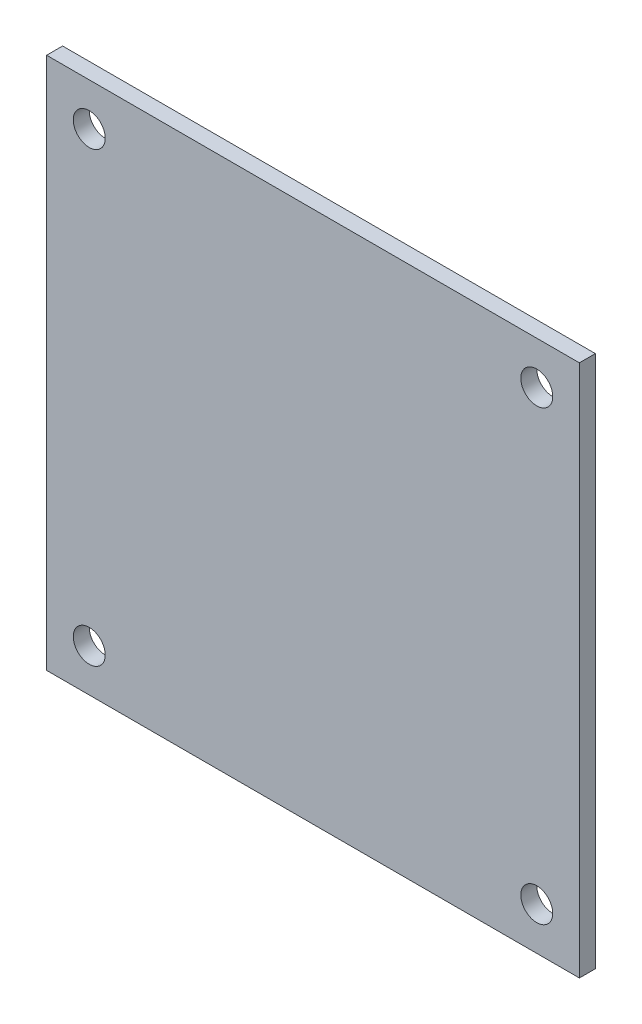
ISO-10303-21;
HEADER;
FILE_DESCRIPTION(('STEP AP214'),'2;1');
FILE_NAME('part.step','',(''),(''),'','','');
FILE_SCHEMA(('AUTOMOTIVE_DESIGN { 1 0 10303 214 1 1 1 1 }'));
ENDSEC;
DATA;
#1=APPLICATION_CONTEXT('core data for automotive mechanical design processes');
#2=APPLICATION_PROTOCOL_DEFINITION('international standard','automotive_design',2000,#1);
#3=PRODUCT_CONTEXT('',#1,'mechanical');
#4=PRODUCT('Part','Part','',(#3));
#5=PRODUCT_RELATED_PRODUCT_CATEGORY('part','',(#4));
#6=PRODUCT_DEFINITION_FORMATION('','',#4);
#7=PRODUCT_DEFINITION_CONTEXT('part definition',#1,'design');
#8=PRODUCT_DEFINITION('design','',#6,#7);
#9=PRODUCT_DEFINITION_SHAPE('','',#8);
#10=(LENGTH_UNIT() NAMED_UNIT(*) SI_UNIT(.MILLI.,.METRE.));
#11=(NAMED_UNIT(*) PLANE_ANGLE_UNIT() SI_UNIT($,.RADIAN.));
#12=(NAMED_UNIT(*) SI_UNIT($,.STERADIAN.) SOLID_ANGLE_UNIT());
#13=UNCERTAINTY_MEASURE_WITH_UNIT(LENGTH_MEASURE(1.E-05),#10,'distance_accuracy_value','');
#14=(GEOMETRIC_REPRESENTATION_CONTEXT(3) GLOBAL_UNCERTAINTY_ASSIGNED_CONTEXT((#13)) GLOBAL_UNIT_ASSIGNED_CONTEXT((#10,
#11,#12)) REPRESENTATION_CONTEXT('',''));
#15=CARTESIAN_POINT('',(0.,0.,0.));
#16=DIRECTION('',(0.,0.,1.));
#17=DIRECTION('',(1.,0.,0.));
#18=AXIS2_PLACEMENT_3D('',#15,#16,#17);
#19=CARTESIAN_POINT('',(-16.7503442350181,33.8891014975042,1.5));
#20=DIRECTION('',(1.,0.,0.));
#21=DIRECTION('',(0.,1.,0.));
#22=AXIS2_PLACEMENT_3D('',#19,#20,#21);
#23=PLANE('',#22);
#24=DIRECTION('',(0.,-1.,0.));
#25=VECTOR('',#24,1.);
#26=CARTESIAN_POINT('',(-16.7503442350181,33.8891014975042,0.));
#27=LINE('',#26,#25);
#28=CARTESIAN_POINT('',(-16.7503442350181,33.8891014975042,0.));
#29=VERTEX_POINT('',#28);
#30=CARTESIAN_POINT('',(-16.7503442350181,-16.1108985024958,0.));
#31=VERTEX_POINT('',#30);
#32=EDGE_CURVE('E97',#29,#31,#27,.T.);
#33=ORIENTED_EDGE('',*,*,#32,.T.);
#34=DIRECTION('',(0.,0.,-1.));
#35=VECTOR('',#34,1.);
#36=CARTESIAN_POINT('',(-16.7503442350181,-16.1108985024958,1.5));
#37=LINE('',#36,#35);
#38=CARTESIAN_POINT('',(-16.7503442350181,-16.1108985024958,1.5));
#39=VERTEX_POINT('',#38);
#40=EDGE_CURVE('E11',#39,#31,#37,.T.);
#41=ORIENTED_EDGE('',*,*,#40,.F.);
#42=DIRECTION('',(0.,-1.,0.));
#43=VECTOR('',#42,1.);
#44=CARTESIAN_POINT('',(-16.7503442350181,33.8891014975042,1.5));
#45=LINE('',#44,#43);
#46=CARTESIAN_POINT('',(-16.7503442350181,33.8891014975042,1.5));
#47=VERTEX_POINT('',#46);
#48=EDGE_CURVE('E84',#47,#39,#45,.T.);
#49=ORIENTED_EDGE('',*,*,#48,.F.);
#50=DIRECTION('',(0.,0.,-1.));
#51=VECTOR('',#50,1.);
#52=CARTESIAN_POINT('',(-16.7503442350181,33.8891014975042,1.5));
#53=LINE('',#52,#51);
#54=EDGE_CURVE('E93',#47,#29,#53,.T.);
#55=ORIENTED_EDGE('',*,*,#54,.T.);
#56=EDGE_LOOP('',(#33,#41,#49,#55));
#57=FACE_BOUND('',#56,.T.);
#58=ADVANCED_FACE('F31',(#57),#23,.F.);
#59=CARTESIAN_POINT('',(-16.7503442350181,-16.1108985024958,1.5));
#60=DIRECTION('',(0.,1.,0.));
#61=DIRECTION('',(0.,0.,1.));
#62=AXIS2_PLACEMENT_3D('',#59,#60,#61);
#63=PLANE('',#62);
#64=DIRECTION('',(1.,0.,0.));
#65=VECTOR('',#64,1.);
#66=CARTESIAN_POINT('',(-16.7503442350181,-16.1108985024958,0.));
#67=LINE('',#66,#65);
#68=CARTESIAN_POINT('',(33.2496557649819,-16.1108985024958,0.));
#69=VERTEX_POINT('',#68);
#70=EDGE_CURVE('E88',#31,#69,#67,.T.);
#71=ORIENTED_EDGE('',*,*,#70,.T.);
#72=DIRECTION('',(0.,0.,-1.));
#73=VECTOR('',#72,1.);
#74=CARTESIAN_POINT('',(33.2496557649819,-16.1108985024958,1.5));
#75=LINE('',#74,#73);
#76=CARTESIAN_POINT('',(33.2496557649819,-16.1108985024958,1.5));
#77=VERTEX_POINT('',#76);
#78=EDGE_CURVE('E40',#77,#69,#75,.T.);
#79=ORIENTED_EDGE('',*,*,#78,.F.);
#80=DIRECTION('',(1.,0.,0.));
#81=VECTOR('',#80,1.);
#82=CARTESIAN_POINT('',(-16.7503442350181,-16.1108985024958,1.5));
#83=LINE('',#82,#81);
#84=EDGE_CURVE('E79',#39,#77,#83,.T.);
#85=ORIENTED_EDGE('',*,*,#84,.F.);
#86=ORIENTED_EDGE('',*,*,#40,.T.);
#87=EDGE_LOOP('',(#71,#79,#85,#86));
#88=FACE_BOUND('',#87,.T.);
#89=ADVANCED_FACE('F87',(#88),#63,.F.);
#90=CARTESIAN_POINT('',(33.2496557649819,33.8891014975042,1.5));
#91=DIRECTION('',(-1.,0.,0.));
#92=DIRECTION('',(0.,-1.,0.));
#93=AXIS2_PLACEMENT_3D('',#90,#91,#92);
#94=PLANE('',#93);
#95=DIRECTION('',(0.,1.,0.));
#96=VECTOR('',#95,1.);
#97=CARTESIAN_POINT('',(33.2496557649819,33.8891014975042,0.));
#98=LINE('',#97,#96);
#99=CARTESIAN_POINT('',(33.2496557649819,33.8891014975042,0.));
#100=VERTEX_POINT('',#99);
#101=EDGE_CURVE('E66',#69,#100,#98,.T.);
#102=ORIENTED_EDGE('',*,*,#101,.T.);
#103=DIRECTION('',(0.,0.,-1.));
#104=VECTOR('',#103,1.);
#105=CARTESIAN_POINT('',(33.2496557649819,33.8891014975042,1.5));
#106=LINE('',#105,#104);
#107=CARTESIAN_POINT('',(33.2496557649819,33.8891014975042,1.5));
#108=VERTEX_POINT('',#107);
#109=EDGE_CURVE('E89',#108,#100,#106,.T.);
#110=ORIENTED_EDGE('',*,*,#109,.F.);
#111=DIRECTION('',(0.,1.,0.));
#112=VECTOR('',#111,1.);
#113=CARTESIAN_POINT('',(33.2496557649819,33.8891014975042,1.5));
#114=LINE('',#113,#112);
#115=EDGE_CURVE('E82',#77,#108,#114,.T.);
#116=ORIENTED_EDGE('',*,*,#115,.F.);
#117=ORIENTED_EDGE('',*,*,#78,.T.);
#118=EDGE_LOOP('',(#102,#110,#116,#117));
#119=FACE_BOUND('',#118,.T.);
#120=ADVANCED_FACE('F91',(#119),#94,.F.);
#121=CARTESIAN_POINT('',(-16.7503442350181,33.8891014975042,1.5));
#122=DIRECTION('',(0.,-1.,0.));
#123=DIRECTION('',(0.,0.,-1.));
#124=AXIS2_PLACEMENT_3D('',#121,#122,#123);
#125=PLANE('',#124);
#126=DIRECTION('',(-1.,0.,0.));
#127=VECTOR('',#126,1.);
#128=CARTESIAN_POINT('',(-16.7503442350181,33.8891014975042,0.));
#129=LINE('',#128,#127);
#130=EDGE_CURVE('E72',#100,#29,#129,.T.);
#131=ORIENTED_EDGE('',*,*,#130,.T.);
#132=ORIENTED_EDGE('',*,*,#54,.F.);
#133=DIRECTION('',(-1.,0.,0.));
#134=VECTOR('',#133,1.);
#135=CARTESIAN_POINT('',(-16.7503442350181,33.8891014975042,1.5));
#136=LINE('',#135,#134);
#137=EDGE_CURVE('E49',#108,#47,#136,.T.);
#138=ORIENTED_EDGE('',*,*,#137,.F.);
#139=ORIENTED_EDGE('',*,*,#109,.T.);
#140=EDGE_LOOP('',(#131,#132,#138,#139));
#141=FACE_BOUND('',#140,.T.);
#142=ADVANCED_FACE('F135',(#141),#125,.F.);
#143=CARTESIAN_POINT('',(-16.7503442350181,-16.1108985024958,1.5));
#144=DIRECTION('',(0.,0.,1.));
#145=DIRECTION('',(1.,0.,0.));
#146=AXIS2_PLACEMENT_3D('',#143,#144,#145);
#147=PLANE('',#146);
#148=CARTESIAN_POINT('',(29.2496557649819,-12.1108985024957,1.5));
#149=DIRECTION('',(0.,0.,1.));
#150=DIRECTION('',(1.,0.,0.));
#151=AXIS2_PLACEMENT_3D('',#148,#149,#150);
#152=CIRCLE('',#151,1.5);
#153=CARTESIAN_POINT('',(30.7496557649819,-12.1108985024957,1.5));
#154=VERTEX_POINT('',#153);
#155=EDGE_CURVE('E124',#154,#154,#152,.T.);
#156=ORIENTED_EDGE('',*,*,#155,.F.);
#157=EDGE_LOOP('',(#156));
#158=FACE_BOUND('',#157,.T.);
#159=CARTESIAN_POINT('',(29.2496557649818,29.8891014975042,1.5));
#160=DIRECTION('',(0.,0.,1.));
#161=DIRECTION('',(1.,0.,0.));
#162=AXIS2_PLACEMENT_3D('',#159,#160,#161);
#163=CIRCLE('',#162,1.5);
#164=CARTESIAN_POINT('',(30.7496557649818,29.8891014975042,1.5));
#165=VERTEX_POINT('',#164);
#166=EDGE_CURVE('E114',#165,#165,#163,.T.);
#167=ORIENTED_EDGE('',*,*,#166,.F.);
#168=EDGE_LOOP('',(#167));
#169=FACE_BOUND('',#168,.T.);
#170=CARTESIAN_POINT('',(-12.7503442350181,29.8891014975041,1.5));
#171=DIRECTION('',(0.,0.,1.));
#172=DIRECTION('',(1.,0.,0.));
#173=AXIS2_PLACEMENT_3D('',#170,#171,#172);
#174=CIRCLE('',#173,1.5);
#175=CARTESIAN_POINT('',(-11.2503442350181,29.8891014975041,1.5));
#176=VERTEX_POINT('',#175);
#177=EDGE_CURVE('E111',#176,#176,#174,.T.);
#178=ORIENTED_EDGE('',*,*,#177,.F.);
#179=EDGE_LOOP('',(#178));
#180=FACE_BOUND('',#179,.T.);
#181=CARTESIAN_POINT('',(-12.750344235018,-12.1108985024958,1.5));
#182=DIRECTION('',(0.,0.,1.));
#183=DIRECTION('',(1.,0.,0.));
#184=AXIS2_PLACEMENT_3D('',#181,#182,#183);
#185=CIRCLE('',#184,1.5);
#186=CARTESIAN_POINT('',(-11.250344235018,-12.1108985024958,1.5));
#187=VERTEX_POINT('',#186);
#188=EDGE_CURVE('E108',#187,#187,#185,.T.);
#189=ORIENTED_EDGE('',*,*,#188,.F.);
#190=EDGE_LOOP('',(#189));
#191=FACE_BOUND('',#190,.T.);
#192=ORIENTED_EDGE('',*,*,#48,.T.);
#193=ORIENTED_EDGE('',*,*,#84,.T.);
#194=ORIENTED_EDGE('',*,*,#115,.T.);
#195=ORIENTED_EDGE('',*,*,#137,.T.);
#196=EDGE_LOOP('',(#192,#193,#194,#195));
#197=FACE_BOUND('',#196,.T.);
#198=ADVANCED_FACE('F80',(#158,#169,#180,#191,#197),#147,.T.);
#199=CARTESIAN_POINT('',(-16.7503442350181,-16.1108985024958,0.));
#200=DIRECTION('',(0.,0.,1.));
#201=DIRECTION('',(1.,0.,0.));
#202=AXIS2_PLACEMENT_3D('',#199,#200,#201);
#203=PLANE('',#202);
#204=CARTESIAN_POINT('',(29.2496557649819,-12.1108985024957,0.));
#205=DIRECTION('',(0.,0.,1.));
#206=DIRECTION('',(1.,0.,0.));
#207=AXIS2_PLACEMENT_3D('',#204,#205,#206);
#208=CIRCLE('',#207,1.5);
#209=CARTESIAN_POINT('',(30.7496557649819,-12.1108985024957,0.));
#210=VERTEX_POINT('',#209);
#211=EDGE_CURVE('E34',#210,#210,#208,.T.);
#212=ORIENTED_EDGE('',*,*,#211,.T.);
#213=EDGE_LOOP('',(#212));
#214=FACE_BOUND('',#213,.T.);
#215=CARTESIAN_POINT('',(29.2496557649818,29.8891014975042,0.));
#216=DIRECTION('',(0.,0.,1.));
#217=DIRECTION('',(1.,0.,0.));
#218=AXIS2_PLACEMENT_3D('',#215,#216,#217);
#219=CIRCLE('',#218,1.5);
#220=CARTESIAN_POINT('',(30.7496557649818,29.8891014975042,0.));
#221=VERTEX_POINT('',#220);
#222=EDGE_CURVE('E112',#221,#221,#219,.T.);
#223=ORIENTED_EDGE('',*,*,#222,.T.);
#224=EDGE_LOOP('',(#223));
#225=FACE_BOUND('',#224,.T.);
#226=CARTESIAN_POINT('',(-12.7503442350181,29.8891014975041,0.));
#227=DIRECTION('',(0.,0.,1.));
#228=DIRECTION('',(1.,0.,0.));
#229=AXIS2_PLACEMENT_3D('',#226,#227,#228);
#230=CIRCLE('',#229,1.5);
#231=CARTESIAN_POINT('',(-11.2503442350181,29.8891014975041,0.));
#232=VERTEX_POINT('',#231);
#233=EDGE_CURVE('E109',#232,#232,#230,.T.);
#234=ORIENTED_EDGE('',*,*,#233,.T.);
#235=EDGE_LOOP('',(#234));
#236=FACE_BOUND('',#235,.T.);
#237=CARTESIAN_POINT('',(-12.750344235018,-12.1108985024958,0.));
#238=DIRECTION('',(0.,0.,1.));
#239=DIRECTION('',(1.,0.,0.));
#240=AXIS2_PLACEMENT_3D('',#237,#238,#239);
#241=CIRCLE('',#240,1.5);
#242=CARTESIAN_POINT('',(-11.250344235018,-12.1108985024958,0.));
#243=VERTEX_POINT('',#242);
#244=EDGE_CURVE('E100',#243,#243,#241,.T.);
#245=ORIENTED_EDGE('',*,*,#244,.T.);
#246=EDGE_LOOP('',(#245));
#247=FACE_BOUND('',#246,.T.);
#248=ORIENTED_EDGE('',*,*,#32,.F.);
#249=ORIENTED_EDGE('',*,*,#130,.F.);
#250=ORIENTED_EDGE('',*,*,#101,.F.);
#251=ORIENTED_EDGE('',*,*,#70,.F.);
#252=EDGE_LOOP('',(#248,#249,#250,#251));
#253=FACE_BOUND('',#252,.T.);
#254=ADVANCED_FACE('F134',(#214,#225,#236,#247,#253),#203,.F.);
#255=CARTESIAN_POINT('',(-12.750344235018,-12.1108985024958,-1.5));
#256=DIRECTION('',(0.,0.,1.));
#257=DIRECTION('',(1.,0.,0.));
#258=AXIS2_PLACEMENT_3D('',#255,#256,#257);
#259=CYLINDRICAL_SURFACE('',#258,1.5);
#260=ORIENTED_EDGE('',*,*,#188,.T.);
#261=EDGE_LOOP('',(#260));
#262=FACE_BOUND('',#261,.T.);
#263=ORIENTED_EDGE('',*,*,#244,.F.);
#264=EDGE_LOOP('',(#263));
#265=FACE_BOUND('',#264,.T.);
#266=ADVANCED_FACE('F130',(#262,#265),#259,.F.);
#267=CARTESIAN_POINT('',(-12.7503442350181,29.8891014975041,-1.5));
#268=DIRECTION('',(0.,0.,1.));
#269=DIRECTION('',(1.,0.,0.));
#270=AXIS2_PLACEMENT_3D('',#267,#268,#269);
#271=CYLINDRICAL_SURFACE('',#270,1.5);
#272=ORIENTED_EDGE('',*,*,#177,.T.);
#273=EDGE_LOOP('',(#272));
#274=FACE_BOUND('',#273,.T.);
#275=ORIENTED_EDGE('',*,*,#233,.F.);
#276=EDGE_LOOP('',(#275));
#277=FACE_BOUND('',#276,.T.);
#278=ADVANCED_FACE('F182',(#274,#277),#271,.F.);
#279=CARTESIAN_POINT('',(29.2496557649818,29.8891014975042,-1.5));
#280=DIRECTION('',(0.,0.,1.));
#281=DIRECTION('',(1.,0.,0.));
#282=AXIS2_PLACEMENT_3D('',#279,#280,#281);
#283=CYLINDRICAL_SURFACE('',#282,1.5);
#284=ORIENTED_EDGE('',*,*,#166,.T.);
#285=EDGE_LOOP('',(#284));
#286=FACE_BOUND('',#285,.T.);
#287=ORIENTED_EDGE('',*,*,#222,.F.);
#288=EDGE_LOOP('',(#287));
#289=FACE_BOUND('',#288,.T.);
#290=ADVANCED_FACE('F187',(#286,#289),#283,.F.);
#291=CARTESIAN_POINT('',(29.2496557649819,-12.1108985024957,-1.5));
#292=DIRECTION('',(0.,0.,1.));
#293=DIRECTION('',(1.,0.,0.));
#294=AXIS2_PLACEMENT_3D('',#291,#292,#293);
#295=CYLINDRICAL_SURFACE('',#294,1.5);
#296=ORIENTED_EDGE('',*,*,#155,.T.);
#297=EDGE_LOOP('',(#296));
#298=FACE_BOUND('',#297,.T.);
#299=ORIENTED_EDGE('',*,*,#211,.F.);
#300=EDGE_LOOP('',(#299));
#301=FACE_BOUND('',#300,.T.);
#302=ADVANCED_FACE('F195',(#298,#301),#295,.F.);
#303=CLOSED_SHELL('',(#58,#89,#120,#142,#198,#254,#266,#278,#290,#302));
#304=MANIFOLD_SOLID_BREP('B2',#303);
#305=ADVANCED_BREP_SHAPE_REPRESENTATION('',(#18,#304),#14);
#306=SHAPE_DEFINITION_REPRESENTATION(#9,#305);
ENDSEC;
END-ISO-10303-21;
